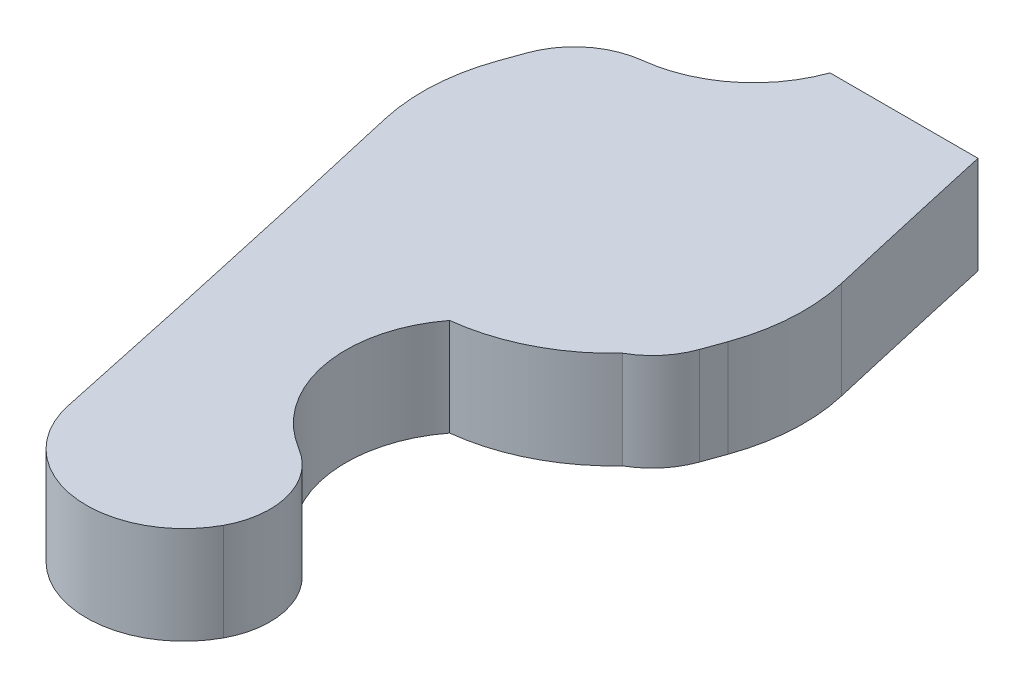
ISO-10303-21;
HEADER;
FILE_DESCRIPTION(('STEP AP214'),'2;1');
FILE_NAME('part.step','',(''),(''),'','','');
FILE_SCHEMA(('AUTOMOTIVE_DESIGN { 1 0 10303 214 1 1 1 1 }'));
ENDSEC;
DATA;
#1=APPLICATION_CONTEXT('core data for automotive mechanical design processes');
#2=APPLICATION_PROTOCOL_DEFINITION('international standard','automotive_design',2000,#1);
#3=PRODUCT_CONTEXT('',#1,'mechanical');
#4=PRODUCT('Part','Part','',(#3));
#5=PRODUCT_RELATED_PRODUCT_CATEGORY('part','',(#4));
#6=PRODUCT_DEFINITION_FORMATION('','',#4);
#7=PRODUCT_DEFINITION_CONTEXT('part definition',#1,'design');
#8=PRODUCT_DEFINITION('design','',#6,#7);
#9=PRODUCT_DEFINITION_SHAPE('','',#8);
#10=(LENGTH_UNIT() NAMED_UNIT(*) SI_UNIT(.MILLI.,.METRE.));
#11=(NAMED_UNIT(*) PLANE_ANGLE_UNIT() SI_UNIT($,.RADIAN.));
#12=(NAMED_UNIT(*) SI_UNIT($,.STERADIAN.) SOLID_ANGLE_UNIT());
#13=UNCERTAINTY_MEASURE_WITH_UNIT(LENGTH_MEASURE(1.E-05),#10,'distance_accuracy_value','');
#14=(GEOMETRIC_REPRESENTATION_CONTEXT(3) GLOBAL_UNCERTAINTY_ASSIGNED_CONTEXT((#13)) GLOBAL_UNIT_ASSIGNED_CONTEXT((#10,
#11,#12)) REPRESENTATION_CONTEXT('',''));
#15=CARTESIAN_POINT('',(0.,0.,0.));
#16=DIRECTION('',(0.,0.,1.));
#17=DIRECTION('',(1.,0.,0.));
#18=AXIS2_PLACEMENT_3D('',#15,#16,#17);
#19=CARTESIAN_POINT('',(-1042.44610443186,-70.9999990463309,-373.240782828531));
#20=DIRECTION('',(0.,1.,0.));
#21=DIRECTION('',(0.,0.,1.));
#22=AXIS2_PLACEMENT_3D('',#19,#20,#21);
#23=CYLINDRICAL_SURFACE('',#22,1097.5000000504);
#24=DIRECTION('',(0.,1.,0.));
#25=VECTOR('',#24,1.);
#26=CARTESIAN_POINT('',(-8.79233761104196,-70.9999990463258,-4.36934120182274));
#27=LINE('',#26,#25);
#28=CARTESIAN_POINT('',(-8.79233761101839,-71.0000047677982,-4.3693412018888));
#29=VERTEX_POINT('',#28);
#30=CARTESIAN_POINT('',(-8.79233761101839,-66.,-4.36934120188887));
#31=VERTEX_POINT('',#30);
#32=EDGE_CURVE('E180',#29,#31,#27,.T.);
#33=ORIENTED_EDGE('',*,*,#32,.F.);
#34=CARTESIAN_POINT('',(-1042.44610443186,-71.0000047678049,-373.240782828531));
#35=DIRECTION('',(0.,1.,0.));
#36=DIRECTION('',(0.,0.,1.));
#37=AXIS2_PLACEMENT_3D('',#34,#35,#36);
#38=CIRCLE('',#37,1097.5000000504);
#39=CARTESIAN_POINT('',(-9.17936285188351,-71.0000047677998,-3.28660883487271));
#40=VERTEX_POINT('',#39);
#41=EDGE_CURVE('E131',#29,#40,#38,.F.);
#42=ORIENTED_EDGE('',*,*,#41,.T.);
#43=DIRECTION('',(0.,1.,0.));
#44=VECTOR('',#43,1.);
#45=CARTESIAN_POINT('',(-9.1793628518835,-67.35,-3.28660883487277));
#46=LINE('',#45,#44);
#47=CARTESIAN_POINT('',(-9.17936285188351,-66.,-3.28660883487272));
#48=VERTEX_POINT('',#47);
#49=EDGE_CURVE('E130',#48,#40,#46,.F.);
#50=ORIENTED_EDGE('',*,*,#49,.F.);
#51=CARTESIAN_POINT('',(-1042.44610443186,-65.999999999999,-373.240782828531));
#52=DIRECTION('',(0.,-1.,0.));
#53=DIRECTION('',(0.,0.,-1.));
#54=AXIS2_PLACEMENT_3D('',#51,#52,#53);
#55=CIRCLE('',#54,1097.5000000504);
#56=EDGE_CURVE('E20',#31,#48,#55,.T.);
#57=ORIENTED_EDGE('',*,*,#56,.F.);
#58=EDGE_LOOP('',(#33,#42,#50,#57));
#59=FACE_BOUND('',#58,.T.);
#60=ADVANCED_FACE('F17',(#59),#23,.F.);
#61=CARTESIAN_POINT('',(1042.44610432514,-70.9999990463207,373.240782790741));
#62=DIRECTION('',(0.,1.,0.));
#63=DIRECTION('',(0.,0.,1.));
#64=AXIS2_PLACEMENT_3D('',#61,#62,#63);
#65=CYLINDRICAL_SURFACE('',#64,1097.49999993719);
#66=DIRECTION('',(0.,1.,0.));
#67=VECTOR('',#66,1.);
#68=CARTESIAN_POINT('',(8.79233761102877,-70.9999990463257,4.36934120185763));
#69=LINE('',#68,#67);
#70=CARTESIAN_POINT('',(8.79233761101129,-71.000004768083,4.36934120190666));
#71=VERTEX_POINT('',#70);
#72=CARTESIAN_POINT('',(8.79233761101129,-66.,4.36934120190659));
#73=VERTEX_POINT('',#72);
#74=EDGE_CURVE('E162',#71,#73,#69,.T.);
#75=ORIENTED_EDGE('',*,*,#74,.F.);
#76=CARTESIAN_POINT('',(1042.44610432514,-71.0000047677913,373.240782790741));
#77=DIRECTION('',(0.,1.,0.));
#78=DIRECTION('',(0.,0.,1.));
#79=AXIS2_PLACEMENT_3D('',#76,#77,#78);
#80=CIRCLE('',#79,1097.49999993719);
#81=CARTESIAN_POINT('',(9.1793628518822,-71.0000047677964,3.28660883487548));
#82=VERTEX_POINT('',#81);
#83=EDGE_CURVE('E194',#71,#82,#80,.F.);
#84=ORIENTED_EDGE('',*,*,#83,.T.);
#85=DIRECTION('',(0.,1.,0.));
#86=VECTOR('',#85,1.);
#87=CARTESIAN_POINT('',(9.17936285188225,-67.35,3.28660883487549));
#88=LINE('',#87,#86);
#89=CARTESIAN_POINT('',(9.1793628518822,-66.,3.28660883487548));
#90=VERTEX_POINT('',#89);
#91=EDGE_CURVE('E166',#90,#82,#88,.F.);
#92=ORIENTED_EDGE('',*,*,#91,.F.);
#93=CARTESIAN_POINT('',(1042.44610432514,-66.000000000001,373.240782790741));
#94=DIRECTION('',(0.,-1.,0.));
#95=DIRECTION('',(0.,0.,-1.));
#96=AXIS2_PLACEMENT_3D('',#93,#94,#95);
#97=CIRCLE('',#96,1097.49999993719);
#98=EDGE_CURVE('E128',#73,#90,#97,.T.);
#99=ORIENTED_EDGE('',*,*,#98,.F.);
#100=EDGE_LOOP('',(#75,#84,#92,#99));
#101=FACE_BOUND('',#100,.T.);
#102=ADVANCED_FACE('F207',(#101),#65,.F.);
#103=CARTESIAN_POINT('',(0.,-71.0000047683717,-2.20684642442516E-13));
#104=DIRECTION('',(0.,1.,0.));
#105=DIRECTION('',(0.,0.,1.));
#106=AXIS2_PLACEMENT_3D('',#103,#104,#105);
#107=PLANE('',#106);
#108=CARTESIAN_POINT('',(1078.76136556438,-71.000004767803,-249.552556918456));
#109=DIRECTION('',(0.,1.,0.));
#110=DIRECTION('',(0.,0.,1.));
#111=AXIS2_PLACEMENT_3D('',#108,#109,#110);
#112=CIRCLE('',#111,1097.49999999949);
#113=CARTESIAN_POINT('',(7.44528645186782,-71.0000047677995,-11.2500000000003));
#114=VERTEX_POINT('',#113);
#115=CARTESIAN_POINT('',(9.4991404960519,-71.0000047677979,-2.19745985998976));
#116=VERTEX_POINT('',#115);
#117=EDGE_CURVE('E167',#114,#116,#112,.T.);
#118=ORIENTED_EDGE('',*,*,#117,.T.);
#119=CARTESIAN_POINT('',(0.,-71.0000047677964,-2.20407084701365E-13));
#120=DIRECTION('',(0.,1.,0.));
#121=DIRECTION('',(0.,0.,1.));
#122=AXIS2_PLACEMENT_3D('',#119,#120,#121);
#123=CIRCLE('',#122,9.75);
#124=EDGE_CURVE('E164',#82,#116,#123,.T.);
#125=ORIENTED_EDGE('',*,*,#124,.F.);
#126=ORIENTED_EDGE('',*,*,#83,.F.);
#127=CARTESIAN_POINT('',(5.02503458858566,-71.0000047683718,3.024935036635));
#128=DIRECTION('',(0.,1.,0.));
#129=DIRECTION('',(0.,0.,1.));
#130=AXIS2_PLACEMENT_3D('',#127,#128,#129);
#131=CIRCLE('',#130,3.9999999999997);
#132=CARTESIAN_POINT('',(6.98622741874707,-71.0000047683717,6.51115400321194));
#133=VERTEX_POINT('',#132);
#134=EDGE_CURVE('E159',#133,#71,#131,.T.);
#135=ORIENTED_EDGE('',*,*,#134,.F.);
#136=CARTESIAN_POINT('',(0.,-71.0000047683716,-2.20684642442516E-13));
#137=DIRECTION('',(0.,-1.,0.));
#138=DIRECTION('',(0.,0.,-1.));
#139=AXIS2_PLACEMENT_3D('',#136,#137,#138);
#140=CIRCLE('',#139,9.55);
#141=CARTESIAN_POINT('',(1.10218454586296,-71.0000047683716,9.48618412360084));
#142=VERTEX_POINT('',#141);
#143=EDGE_CURVE('E156',#142,#133,#140,.F.);
#144=ORIENTED_EDGE('',*,*,#143,.F.);
#145=CARTESIAN_POINT('',(6.2513343960095,-71.0000047683715,13.4530791084393));
#146=DIRECTION('',(0.,1.,0.));
#147=DIRECTION('',(0.,0.,1.));
#148=AXIS2_PLACEMENT_3D('',#145,#146,#147);
#149=CIRCLE('',#148,6.5);
#150=CARTESIAN_POINT('',(2.92616396660496,-71.0000047680847,19.038170120716));
#151=VERTEX_POINT('',#150);
#152=EDGE_CURVE('E191',#142,#151,#149,.T.);
#153=ORIENTED_EDGE('',*,*,#152,.T.);
#154=CARTESIAN_POINT('',(0.879905240811216,-71.0000047677979,22.4751492051902));
#155=DIRECTION('',(0.,1.,0.));
#156=DIRECTION('',(0.,0.,1.));
#157=AXIS2_PLACEMENT_3D('',#154,#155,#156);
#158=CIRCLE('',#157,4.);
#159=CARTESIAN_POINT('',(4.39952620405583,-71.0000047677996,24.3757460259519));
#160=VERTEX_POINT('',#159);
#161=EDGE_CURVE('E189',#160,#151,#158,.T.);
#162=ORIENTED_EDGE('',*,*,#161,.F.);
#163=CARTESIAN_POINT('',(0.,-71.0000047677968,22.));
#164=DIRECTION('',(0.,1.,0.));
#165=DIRECTION('',(0.,0.,1.));
#166=AXIS2_PLACEMENT_3D('',#163,#164,#165);
#167=CIRCLE('',#166,5.);
#168=CARTESIAN_POINT('',(-4.89237093814707,-71.0000047677968,23.0318462112178));
#169=VERTEX_POINT('',#168);
#170=EDGE_CURVE('E185',#169,#160,#167,.T.);
#171=ORIENTED_EDGE('',*,*,#170,.F.);
#172=CARTESIAN_POINT('',(-1078.76136556482,-71.0000047677933,249.552556918543));
#173=DIRECTION('',(0.,1.,0.));
#174=DIRECTION('',(0.,0.,1.));
#175=AXIS2_PLACEMENT_3D('',#172,#173,#174);
#176=CIRCLE('',#175,1097.49999999993);
#177=CARTESIAN_POINT('',(-9.49914049605201,-71.0000047677984,2.19745985998938));
#178=VERTEX_POINT('',#177);
#179=EDGE_CURVE('E135',#169,#178,#176,.T.);
#180=ORIENTED_EDGE('',*,*,#179,.T.);
#181=CARTESIAN_POINT('',(0.,-71.0000047677998,-2.20407084701364E-13));
#182=DIRECTION('',(0.,1.,0.));
#183=DIRECTION('',(0.,0.,1.));
#184=AXIS2_PLACEMENT_3D('',#181,#182,#183);
#185=CIRCLE('',#184,9.75);
#186=EDGE_CURVE('E134',#40,#178,#185,.T.);
#187=ORIENTED_EDGE('',*,*,#186,.F.);
#188=ORIENTED_EDGE('',*,*,#41,.F.);
#189=CARTESIAN_POINT('',(-5.02503458858608,-71.0000047677981,-3.024935036635));
#190=DIRECTION('',(0.,1.,0.));
#191=DIRECTION('',(0.,0.,1.));
#192=AXIS2_PLACEMENT_3D('',#189,#190,#191);
#193=CIRCLE('',#192,4.);
#194=CARTESIAN_POINT('',(-5.49219641998549,-71.0000047677982,-6.99756134970343));
#195=VERTEX_POINT('',#194);
#196=EDGE_CURVE('E177',#195,#29,#193,.T.);
#197=ORIENTED_EDGE('',*,*,#196,.F.);
#198=CARTESIAN_POINT('',(-6.2513343960096,-71.0000047677983,-13.4530791084396));
#199=DIRECTION('',(0.,1.,0.));
#200=DIRECTION('',(0.,0.,1.));
#201=AXIS2_PLACEMENT_3D('',#198,#199,#200);
#202=CIRCLE('',#201,6.5);
#203=CARTESIAN_POINT('',(-0.136071323830459,-71.0000047677988,-11.2500000000002));
#204=VERTEX_POINT('',#203);
#205=EDGE_CURVE('E172',#195,#204,#202,.T.);
#206=ORIENTED_EDGE('',*,*,#205,.T.);
#207=DIRECTION('',(-1.,0.,0.));
#208=VECTOR('',#207,1.);
#209=CARTESIAN_POINT('',(-12.2499999999998,-71.0000047677994,-11.2500000000003));
#210=LINE('',#209,#208);
#211=EDGE_CURVE('E175',#114,#204,#210,.T.);
#212=ORIENTED_EDGE('',*,*,#211,.F.);
#213=EDGE_LOOP('',(#118,#125,#126,#135,#144,#153,#162,#171,#180,#187,#188,#197,#206,#212));
#214=FACE_BOUND('',#213,.T.);
#215=ADVANCED_FACE('F246',(#214),#107,.F.);
#216=CARTESIAN_POINT('',(6.2513343960095,-70.9999990463256,13.4530791084393));
#217=DIRECTION('',(0.,1.,0.));
#218=DIRECTION('',(0.,0.,1.));
#219=AXIS2_PLACEMENT_3D('',#216,#217,#218);
#220=CYLINDRICAL_SURFACE('',#219,6.5);
#221=DIRECTION('',(0.,1.,0.));
#222=VECTOR('',#221,1.);
#223=CARTESIAN_POINT('',(2.92616396660496,-70.9999990463256,19.038170120716));
#224=LINE('',#223,#222);
#225=CARTESIAN_POINT('',(2.926163966603,-66.,19.0381701207148));
#226=VERTEX_POINT('',#225);
#227=EDGE_CURVE('E188',#151,#226,#224,.T.);
#228=ORIENTED_EDGE('',*,*,#227,.F.);
#229=ORIENTED_EDGE('',*,*,#152,.F.);
#230=DIRECTION('',(0.,-1.,0.));
#231=VECTOR('',#230,1.);
#232=CARTESIAN_POINT('',(1.10218454586288,-65.,9.48618412360084));
#233=LINE('',#232,#231);
#234=CARTESIAN_POINT('',(1.10218454586293,-66.0000000000001,9.48618412360084));
#235=VERTEX_POINT('',#234);
#236=EDGE_CURVE('E158',#235,#142,#233,.T.);
#237=ORIENTED_EDGE('',*,*,#236,.F.);
#238=CARTESIAN_POINT('',(6.2513343960095,-66.0000000000001,13.4530791084392));
#239=DIRECTION('',(0.,1.,0.));
#240=DIRECTION('',(0.,0.,1.));
#241=AXIS2_PLACEMENT_3D('',#238,#239,#240);
#242=CIRCLE('',#241,6.5);
#243=EDGE_CURVE('E153',#235,#226,#242,.T.);
#244=ORIENTED_EDGE('',*,*,#243,.T.);
#245=EDGE_LOOP('',(#228,#229,#237,#244));
#246=FACE_BOUND('',#245,.T.);
#247=ADVANCED_FACE('F284',(#246),#220,.F.);
#248=CARTESIAN_POINT('',(0.879905240811216,-70.9999990463255,22.4751492051902));
#249=DIRECTION('',(0.,1.,0.));
#250=DIRECTION('',(0.,0.,1.));
#251=AXIS2_PLACEMENT_3D('',#248,#249,#250);
#252=CYLINDRICAL_SURFACE('',#251,4.);
#253=ORIENTED_EDGE('',*,*,#161,.T.);
#254=ORIENTED_EDGE('',*,*,#227,.T.);
#255=CARTESIAN_POINT('',(0.879905240811217,-65.9999999999999,22.4751492051901));
#256=DIRECTION('',(0.,1.,0.));
#257=DIRECTION('',(0.,0.,1.));
#258=AXIS2_PLACEMENT_3D('',#255,#256,#257);
#259=CIRCLE('',#258,4.);
#260=CARTESIAN_POINT('',(4.39952620405583,-65.9999999999998,24.3757460259518));
#261=VERTEX_POINT('',#260);
#262=EDGE_CURVE('E150',#226,#261,#259,.F.);
#263=ORIENTED_EDGE('',*,*,#262,.T.);
#264=DIRECTION('',(0.,1.,0.));
#265=VECTOR('',#264,1.);
#266=CARTESIAN_POINT('',(4.39952620405541,-70.9999990463255,24.3757460259527));
#267=LINE('',#266,#265);
#268=EDGE_CURVE('E187',#160,#261,#267,.T.);
#269=ORIENTED_EDGE('',*,*,#268,.F.);
#270=EDGE_LOOP('',(#253,#254,#263,#269));
#271=FACE_BOUND('',#270,.T.);
#272=ADVANCED_FACE('F287',(#271),#252,.T.);
#273=CARTESIAN_POINT('',(0.,-70.9999990463255,22.));
#274=DIRECTION('',(0.,1.,0.));
#275=DIRECTION('',(0.,0.,1.));
#276=AXIS2_PLACEMENT_3D('',#273,#274,#275);
#277=CYLINDRICAL_SURFACE('',#276,5.);
#278=ORIENTED_EDGE('',*,*,#170,.T.);
#279=ORIENTED_EDGE('',*,*,#268,.T.);
#280=CARTESIAN_POINT('',(0.,-66.,21.9999999999999));
#281=DIRECTION('',(0.,1.,0.));
#282=DIRECTION('',(0.,0.,1.));
#283=AXIS2_PLACEMENT_3D('',#280,#281,#282);
#284=CIRCLE('',#283,5.);
#285=CARTESIAN_POINT('',(-4.89237093815009,-65.9999999999999,23.0318462112184));
#286=VERTEX_POINT('',#285);
#287=EDGE_CURVE('E144',#261,#286,#284,.F.);
#288=ORIENTED_EDGE('',*,*,#287,.T.);
#289=DIRECTION('',(0.,1.,0.));
#290=VECTOR('',#289,1.);
#291=CARTESIAN_POINT('',(-4.89237093815009,-70.9999990463255,23.0318462112185));
#292=LINE('',#291,#290);
#293=EDGE_CURVE('E184',#286,#169,#292,.F.);
#294=ORIENTED_EDGE('',*,*,#293,.T.);
#295=EDGE_LOOP('',(#278,#279,#288,#294));
#296=FACE_BOUND('',#295,.T.);
#297=ADVANCED_FACE('F291',(#296),#277,.T.);
#298=CARTESIAN_POINT('',(-1078.76136556482,-70.999999046322,249.552556918543));
#299=DIRECTION('',(0.,1.,0.));
#300=DIRECTION('',(0.,0.,1.));
#301=AXIS2_PLACEMENT_3D('',#298,#299,#300);
#302=CYLINDRICAL_SURFACE('',#301,1097.49999999993);
#303=DIRECTION('',(0.,1.,0.));
#304=VECTOR('',#303,1.);
#305=CARTESIAN_POINT('',(-9.49914049604837,-67.35,2.19745986000521));
#306=LINE('',#305,#304);
#307=CARTESIAN_POINT('',(-9.49914049605201,-66.,2.19745985998938));
#308=VERTEX_POINT('',#307);
#309=EDGE_CURVE('E139',#178,#308,#306,.T.);
#310=ORIENTED_EDGE('',*,*,#309,.F.);
#311=ORIENTED_EDGE('',*,*,#179,.F.);
#312=ORIENTED_EDGE('',*,*,#293,.F.);
#313=CARTESIAN_POINT('',(-1078.76136556482,-65.9999999999962,249.552556918543));
#314=DIRECTION('',(0.,1.,0.));
#315=DIRECTION('',(0.,0.,1.));
#316=AXIS2_PLACEMENT_3D('',#313,#314,#315);
#317=CIRCLE('',#316,1097.49999999993);
#318=EDGE_CURVE('E140',#286,#308,#317,.T.);
#319=ORIENTED_EDGE('',*,*,#318,.T.);
#320=EDGE_LOOP('',(#310,#311,#312,#319));
#321=FACE_BOUND('',#320,.T.);
#322=ADVANCED_FACE('F294',(#321),#302,.F.);
#323=CARTESIAN_POINT('',(0.,-67.35,-2.21926704451315E-13));
#324=DIRECTION('',(0.,1.,0.));
#325=DIRECTION('',(0.,0.,1.));
#326=AXIS2_PLACEMENT_3D('',#323,#324,#325);
#327=CYLINDRICAL_SURFACE('',#326,9.75);
#328=ORIENTED_EDGE('',*,*,#186,.T.);
#329=ORIENTED_EDGE('',*,*,#309,.T.);
#330=CARTESIAN_POINT('',(0.,-66.,-2.22488754857531E-13));
#331=DIRECTION('',(0.,1.,0.));
#332=DIRECTION('',(0.,0.,1.));
#333=AXIS2_PLACEMENT_3D('',#330,#331,#332);
#334=CIRCLE('',#333,9.75);
#335=EDGE_CURVE('E123',#308,#48,#334,.F.);
#336=ORIENTED_EDGE('',*,*,#335,.T.);
#337=ORIENTED_EDGE('',*,*,#49,.T.);
#338=EDGE_LOOP('',(#328,#329,#336,#337));
#339=FACE_BOUND('',#338,.T.);
#340=ADVANCED_FACE('F137',(#339),#327,.T.);
#341=CARTESIAN_POINT('',(-5.02503458858608,-70.9999990463258,-3.024935036635));
#342=DIRECTION('',(0.,1.,0.));
#343=DIRECTION('',(0.,0.,1.));
#344=AXIS2_PLACEMENT_3D('',#341,#342,#343);
#345=CYLINDRICAL_SURFACE('',#344,4.);
#346=ORIENTED_EDGE('',*,*,#196,.T.);
#347=ORIENTED_EDGE('',*,*,#32,.T.);
#348=CARTESIAN_POINT('',(-5.02503458858608,-66.,-3.02493503663507));
#349=DIRECTION('',(0.,1.,0.));
#350=DIRECTION('',(0.,0.,1.));
#351=AXIS2_PLACEMENT_3D('',#348,#349,#350);
#352=CIRCLE('',#351,4.);
#353=CARTESIAN_POINT('',(-5.49219641998546,-66.,-6.99756134970351));
#354=VERTEX_POINT('',#353);
#355=EDGE_CURVE('E127',#31,#354,#352,.F.);
#356=ORIENTED_EDGE('',*,*,#355,.T.);
#357=DIRECTION('',(0.,1.,0.));
#358=VECTOR('',#357,1.);
#359=CARTESIAN_POINT('',(-5.49219641998546,-70.9999990463259,-6.99756134970344));
#360=LINE('',#359,#358);
#361=EDGE_CURVE('E176',#354,#195,#360,.F.);
#362=ORIENTED_EDGE('',*,*,#361,.T.);
#363=EDGE_LOOP('',(#346,#347,#356,#362));
#364=FACE_BOUND('',#363,.T.);
#365=ADVANCED_FACE('F249',(#364),#345,.T.);
#366=CARTESIAN_POINT('',(-6.2513343960096,-70.999999046326,-13.4530791084396));
#367=DIRECTION('',(0.,1.,0.));
#368=DIRECTION('',(0.,0.,1.));
#369=AXIS2_PLACEMENT_3D('',#366,#367,#368);
#370=CYLINDRICAL_SURFACE('',#369,6.5);
#371=ORIENTED_EDGE('',*,*,#205,.F.);
#372=ORIENTED_EDGE('',*,*,#361,.F.);
#373=CARTESIAN_POINT('',(-6.2513343960096,-66.,-13.4530791084397));
#374=DIRECTION('',(0.,1.,0.));
#375=DIRECTION('',(0.,0.,1.));
#376=AXIS2_PLACEMENT_3D('',#373,#374,#375);
#377=CIRCLE('',#376,6.5);
#378=CARTESIAN_POINT('',(-0.136071323830471,-66.,-11.2500000000002));
#379=VERTEX_POINT('',#378);
#380=EDGE_CURVE('E142',#354,#379,#377,.T.);
#381=ORIENTED_EDGE('',*,*,#380,.T.);
#382=DIRECTION('',(0.,1.,0.));
#383=VECTOR('',#382,1.);
#384=CARTESIAN_POINT('',(-0.136071323830459,-23.,-11.2500000000001));
#385=LINE('',#384,#383);
#386=EDGE_CURVE('E171',#204,#379,#385,.T.);
#387=ORIENTED_EDGE('',*,*,#386,.F.);
#388=EDGE_LOOP('',(#371,#372,#381,#387));
#389=FACE_BOUND('',#388,.T.);
#390=ADVANCED_FACE('F247',(#389),#370,.F.);
#391=CARTESIAN_POINT('',(-12.2499999999998,-23.,-11.2500000000002));
#392=DIRECTION('',(0.,0.,-1.));
#393=DIRECTION('',(-1.,0.,0.));
#394=AXIS2_PLACEMENT_3D('',#391,#392,#393);
#395=PLANE('',#394);
#396=ORIENTED_EDGE('',*,*,#211,.T.);
#397=ORIENTED_EDGE('',*,*,#386,.T.);
#398=DIRECTION('',(1.,0.,0.));
#399=VECTOR('',#398,1.);
#400=CARTESIAN_POINT('',(0.,-66.,-11.2500000000002));
#401=LINE('',#400,#399);
#402=CARTESIAN_POINT('',(7.44528645186771,-66.0000000000003,-11.2500000000004));
#403=VERTEX_POINT('',#402);
#404=EDGE_CURVE('E216',#379,#403,#401,.T.);
#405=ORIENTED_EDGE('',*,*,#404,.T.);
#406=DIRECTION('',(0.,1.,0.));
#407=VECTOR('',#406,1.);
#408=CARTESIAN_POINT('',(7.44528645186771,-70.999999046326,-11.2500000000005));
#409=LINE('',#408,#407);
#410=EDGE_CURVE('E170',#403,#114,#409,.F.);
#411=ORIENTED_EDGE('',*,*,#410,.T.);
#412=EDGE_LOOP('',(#396,#397,#405,#411));
#413=FACE_BOUND('',#412,.T.);
#414=ADVANCED_FACE('F243',(#413),#395,.T.);
#415=CARTESIAN_POINT('',(1078.76136556438,-70.9999990463296,-249.552556918456));
#416=DIRECTION('',(0.,1.,0.));
#417=DIRECTION('',(0.,0.,1.));
#418=AXIS2_PLACEMENT_3D('',#415,#416,#417);
#419=CYLINDRICAL_SURFACE('',#418,1097.49999999949);
#420=CARTESIAN_POINT('',(1078.76136556438,-66.0000000000038,-249.552556918456));
#421=DIRECTION('',(0.,1.,0.));
#422=DIRECTION('',(0.,0.,1.));
#423=AXIS2_PLACEMENT_3D('',#420,#421,#422);
#424=CIRCLE('',#423,1097.49999999949);
#425=CARTESIAN_POINT('',(9.49914049605191,-66.,-2.19745985998977));
#426=VERTEX_POINT('',#425);
#427=EDGE_CURVE('E213',#403,#426,#424,.T.);
#428=ORIENTED_EDGE('',*,*,#427,.T.);
#429=DIRECTION('',(0.,1.,0.));
#430=VECTOR('',#429,1.);
#431=CARTESIAN_POINT('',(9.4991404960483,-67.35,-2.19745986000545));
#432=LINE('',#431,#430);
#433=EDGE_CURVE('E163',#116,#426,#432,.T.);
#434=ORIENTED_EDGE('',*,*,#433,.F.);
#435=ORIENTED_EDGE('',*,*,#117,.F.);
#436=ORIENTED_EDGE('',*,*,#410,.F.);
#437=EDGE_LOOP('',(#428,#434,#435,#436));
#438=FACE_BOUND('',#437,.T.);
#439=ADVANCED_FACE('F256',(#438),#419,.F.);
#440=CARTESIAN_POINT('',(0.,-67.35,-2.21926704451315E-13));
#441=DIRECTION('',(0.,1.,0.));
#442=DIRECTION('',(0.,0.,1.));
#443=AXIS2_PLACEMENT_3D('',#440,#441,#442);
#444=CYLINDRICAL_SURFACE('',#443,9.75);
#445=ORIENTED_EDGE('',*,*,#124,.T.);
#446=ORIENTED_EDGE('',*,*,#433,.T.);
#447=CARTESIAN_POINT('',(0.,-66.,-2.22488754857531E-13));
#448=DIRECTION('',(0.,1.,0.));
#449=DIRECTION('',(0.,0.,1.));
#450=AXIS2_PLACEMENT_3D('',#447,#448,#449);
#451=CIRCLE('',#450,9.75);
#452=EDGE_CURVE('E201',#426,#90,#451,.F.);
#453=ORIENTED_EDGE('',*,*,#452,.T.);
#454=ORIENTED_EDGE('',*,*,#91,.T.);
#455=EDGE_LOOP('',(#445,#446,#453,#454));
#456=FACE_BOUND('',#455,.T.);
#457=ADVANCED_FACE('F211',(#456),#444,.T.);
#458=CARTESIAN_POINT('',(5.02503458858566,-70.9999990463257,3.024935036635));
#459=DIRECTION('',(0.,1.,0.));
#460=DIRECTION('',(0.,0.,1.));
#461=AXIS2_PLACEMENT_3D('',#458,#459,#460);
#462=CYLINDRICAL_SURFACE('',#461,3.9999999999997);
#463=ORIENTED_EDGE('',*,*,#134,.T.);
#464=ORIENTED_EDGE('',*,*,#74,.T.);
#465=CARTESIAN_POINT('',(5.02503458858566,-66.,3.02493503663493));
#466=DIRECTION('',(0.,1.,0.));
#467=DIRECTION('',(0.,0.,1.));
#468=AXIS2_PLACEMENT_3D('',#465,#466,#467);
#469=CIRCLE('',#468,3.9999999999997);
#470=CARTESIAN_POINT('',(6.98622741874714,-66.,6.51115400321187));
#471=VERTEX_POINT('',#470);
#472=EDGE_CURVE('E26',#73,#471,#469,.F.);
#473=ORIENTED_EDGE('',*,*,#472,.T.);
#474=DIRECTION('',(0.,-1.,0.));
#475=VECTOR('',#474,1.);
#476=CARTESIAN_POINT('',(6.98622741874715,-65.,6.51115400321186));
#477=LINE('',#476,#475);
#478=EDGE_CURVE('E34',#133,#471,#477,.F.);
#479=ORIENTED_EDGE('',*,*,#478,.F.);
#480=EDGE_LOOP('',(#463,#464,#473,#479));
#481=FACE_BOUND('',#480,.T.);
#482=ADVANCED_FACE('F266',(#481),#462,.T.);
#483=CARTESIAN_POINT('',(0.,-65.,-2.22905088491766E-13));
#484=DIRECTION('',(0.,-1.,0.));
#485=DIRECTION('',(0.,0.,-1.));
#486=AXIS2_PLACEMENT_3D('',#483,#484,#485);
#487=CYLINDRICAL_SURFACE('',#486,9.55);
#488=ORIENTED_EDGE('',*,*,#143,.T.);
#489=ORIENTED_EDGE('',*,*,#478,.T.);
#490=CARTESIAN_POINT('',(0.,-66.,-2.22535014444333E-13));
#491=DIRECTION('',(0.,-1.,0.));
#492=DIRECTION('',(0.,0.,-1.));
#493=AXIS2_PLACEMENT_3D('',#490,#491,#492);
#494=CIRCLE('',#493,9.55);
#495=EDGE_CURVE('E11',#471,#235,#494,.T.);
#496=ORIENTED_EDGE('',*,*,#495,.T.);
#497=ORIENTED_EDGE('',*,*,#236,.T.);
#498=EDGE_LOOP('',(#488,#489,#496,#497));
#499=FACE_BOUND('',#498,.T.);
#500=ADVANCED_FACE('F261',(#499),#487,.T.);
#501=CARTESIAN_POINT('',(0.,-66.,0.100005032445846));
#502=DIRECTION('',(0.,-1.,0.));
#503=DIRECTION('',(0.,0.,-1.));
#504=AXIS2_PLACEMENT_3D('',#501,#502,#503);
#505=PLANE('',#504);
#506=ORIENTED_EDGE('',*,*,#472,.F.);
#507=ORIENTED_EDGE('',*,*,#98,.T.);
#508=ORIENTED_EDGE('',*,*,#452,.F.);
#509=ORIENTED_EDGE('',*,*,#427,.F.);
#510=ORIENTED_EDGE('',*,*,#404,.F.);
#511=ORIENTED_EDGE('',*,*,#380,.F.);
#512=ORIENTED_EDGE('',*,*,#355,.F.);
#513=ORIENTED_EDGE('',*,*,#56,.T.);
#514=ORIENTED_EDGE('',*,*,#335,.F.);
#515=ORIENTED_EDGE('',*,*,#318,.F.);
#516=ORIENTED_EDGE('',*,*,#287,.F.);
#517=ORIENTED_EDGE('',*,*,#262,.F.);
#518=ORIENTED_EDGE('',*,*,#243,.F.);
#519=ORIENTED_EDGE('',*,*,#495,.F.);
#520=EDGE_LOOP('',(#506,#507,#508,#509,#510,#511,#512,#513,#514,#515,#516,#517,#518,#519));
#521=FACE_BOUND('',#520,.T.);
#522=ADVANCED_FACE('F120',(#521),#505,.F.);
#523=CLOSED_SHELL('',(#60,#102,#215,#247,#272,#297,#322,#340,#365,#390,#414,#439,#457,#482,#500,#522));
#524=MANIFOLD_SOLID_BREP('B1',#523);
#525=ADVANCED_BREP_SHAPE_REPRESENTATION('',(#18,#524),#14);
#526=SHAPE_DEFINITION_REPRESENTATION(#9,#525);
ENDSEC;
END-ISO-10303-21;
